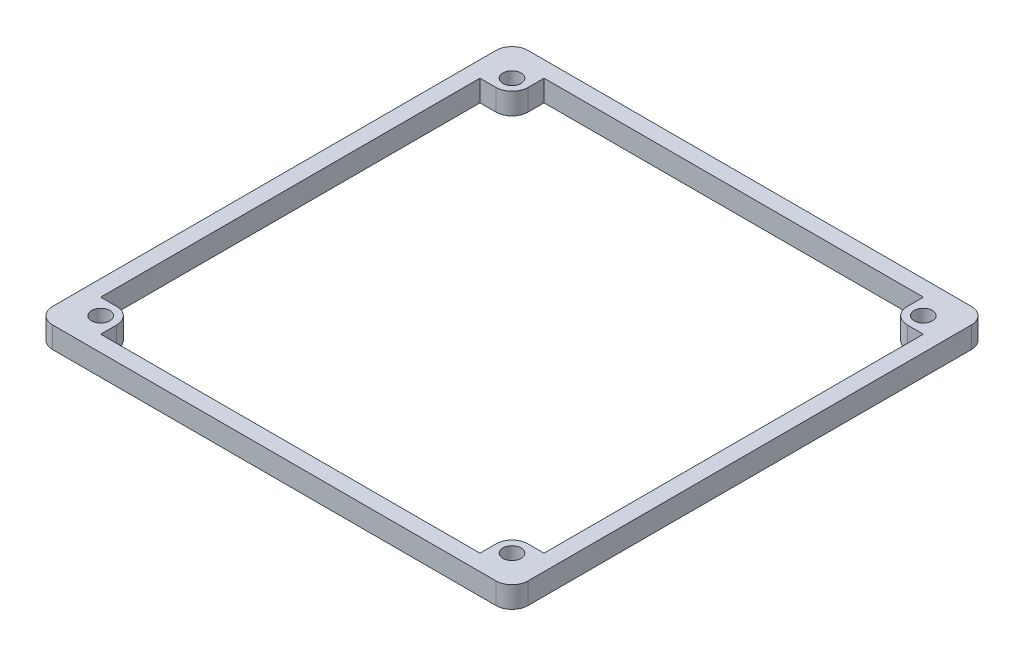
ISO-10303-21;
HEADER;
FILE_DESCRIPTION(('STEP AP214'),'2;1');
FILE_NAME('part.step','',(''),(''),'','','');
FILE_SCHEMA(('AUTOMOTIVE_DESIGN { 1 0 10303 214 1 1 1 1 }'));
ENDSEC;
DATA;
#1=APPLICATION_CONTEXT('core data for automotive mechanical design processes');
#2=APPLICATION_PROTOCOL_DEFINITION('international standard','automotive_design',2000,#1);
#3=PRODUCT_CONTEXT('',#1,'mechanical');
#4=PRODUCT('Part','Part','',(#3));
#5=PRODUCT_RELATED_PRODUCT_CATEGORY('part','',(#4));
#6=PRODUCT_DEFINITION_FORMATION('','',#4);
#7=PRODUCT_DEFINITION_CONTEXT('part definition',#1,'design');
#8=PRODUCT_DEFINITION('design','',#6,#7);
#9=PRODUCT_DEFINITION_SHAPE('','',#8);
#10=(LENGTH_UNIT() NAMED_UNIT(*) SI_UNIT(.MILLI.,.METRE.));
#11=(NAMED_UNIT(*) PLANE_ANGLE_UNIT() SI_UNIT($,.RADIAN.));
#12=(NAMED_UNIT(*) SI_UNIT($,.STERADIAN.) SOLID_ANGLE_UNIT());
#13=UNCERTAINTY_MEASURE_WITH_UNIT(LENGTH_MEASURE(1.E-05),#10,'distance_accuracy_value','');
#14=(GEOMETRIC_REPRESENTATION_CONTEXT(3) GLOBAL_UNCERTAINTY_ASSIGNED_CONTEXT((#13)) GLOBAL_UNIT_ASSIGNED_CONTEXT((#10,
#11,#12)) REPRESENTATION_CONTEXT('',''));
#15=CARTESIAN_POINT('',(0.,0.,0.));
#16=DIRECTION('',(0.,0.,1.));
#17=DIRECTION('',(1.,0.,0.));
#18=AXIS2_PLACEMENT_3D('',#15,#16,#17);
#19=CARTESIAN_POINT('',(0.,2.,0.));
#20=DIRECTION('',(0.,-1.,0.));
#21=DIRECTION('',(0.,0.,-1.));
#22=AXIS2_PLACEMENT_3D('',#19,#20,#21);
#23=PLANE('',#22);
#24=DIRECTION('',(-1.,0.,0.));
#25=VECTOR('',#24,1.);
#26=CARTESIAN_POINT('',(3.,2.,-80.));
#27=LINE('',#26,#25);
#28=CARTESIAN_POINT('',(6.,2.,-80.));
#29=VERTEX_POINT('',#28);
#30=CARTESIAN_POINT('',(3.,2.,-80.));
#31=VERTEX_POINT('',#30);
#32=EDGE_CURVE('E804',#29,#31,#27,.T.);
#33=ORIENTED_EDGE('',*,*,#32,.F.);
#34=CARTESIAN_POINT('',(6.,2.,-83.));
#35=DIRECTION('',(0.,-1.,0.));
#36=DIRECTION('',(0.,0.,-1.));
#37=AXIS2_PLACEMENT_3D('',#34,#35,#36);
#38=CIRCLE('',#37,3.);
#39=CARTESIAN_POINT('',(9.,2.,-83.));
#40=VERTEX_POINT('',#39);
#41=EDGE_CURVE('E310',#29,#40,#38,.F.);
#42=ORIENTED_EDGE('',*,*,#41,.T.);
#43=DIRECTION('',(0.,0.,1.));
#44=VECTOR('',#43,1.);
#45=CARTESIAN_POINT('',(9.,2.,-80.));
#46=LINE('',#45,#44);
#47=CARTESIAN_POINT('',(9.,2.,-86.));
#48=VERTEX_POINT('',#47);
#49=EDGE_CURVE('E228',#48,#40,#46,.T.);
#50=ORIENTED_EDGE('',*,*,#49,.F.);
#51=DIRECTION('',(-1.,0.,0.));
#52=VECTOR('',#51,1.);
#53=CARTESIAN_POINT('',(3.,2.,-86.));
#54=LINE('',#53,#52);
#55=CARTESIAN_POINT('',(80.,2.,-86.));
#56=VERTEX_POINT('',#55);
#57=EDGE_CURVE('E219',#56,#48,#54,.T.);
#58=ORIENTED_EDGE('',*,*,#57,.F.);
#59=DIRECTION('',(0.,0.,-1.));
#60=VECTOR('',#59,1.);
#61=CARTESIAN_POINT('',(80.,2.,-80.));
#62=LINE('',#61,#60);
#63=CARTESIAN_POINT('',(80.,2.,-83.));
#64=VERTEX_POINT('',#63);
#65=EDGE_CURVE('E201',#64,#56,#62,.T.);
#66=ORIENTED_EDGE('',*,*,#65,.F.);
#67=CARTESIAN_POINT('',(83.,2.,-83.));
#68=DIRECTION('',(0.,-1.,0.));
#69=DIRECTION('',(0.,0.,-1.));
#70=AXIS2_PLACEMENT_3D('',#67,#68,#69);
#71=CIRCLE('',#70,3.);
#72=CARTESIAN_POINT('',(83.,2.,-80.));
#73=VERTEX_POINT('',#72);
#74=EDGE_CURVE('E307',#64,#73,#71,.F.);
#75=ORIENTED_EDGE('',*,*,#74,.T.);
#76=DIRECTION('',(-1.,0.,0.));
#77=VECTOR('',#76,1.);
#78=CARTESIAN_POINT('',(80.,2.,-80.));
#79=LINE('',#78,#77);
#80=CARTESIAN_POINT('',(86.,2.,-80.));
#81=VERTEX_POINT('',#80);
#82=EDGE_CURVE('E213',#81,#73,#79,.T.);
#83=ORIENTED_EDGE('',*,*,#82,.F.);
#84=DIRECTION('',(0.,0.,-1.));
#85=VECTOR('',#84,1.);
#86=CARTESIAN_POINT('',(86.,2.,-3.00000000000001));
#87=LINE('',#86,#85);
#88=CARTESIAN_POINT('',(86.,2.,-9.00000000000001));
#89=VERTEX_POINT('',#88);
#90=EDGE_CURVE('E231',#89,#81,#87,.T.);
#91=ORIENTED_EDGE('',*,*,#90,.F.);
#92=DIRECTION('',(1.,0.,0.));
#93=VECTOR('',#92,1.);
#94=CARTESIAN_POINT('',(80.,2.,-9.00000000000001));
#95=LINE('',#94,#93);
#96=CARTESIAN_POINT('',(83.,2.,-9.00000000000001));
#97=VERTEX_POINT('',#96);
#98=EDGE_CURVE('E734',#97,#89,#95,.T.);
#99=ORIENTED_EDGE('',*,*,#98,.F.);
#100=CARTESIAN_POINT('',(83.,2.,-6.00000000000001));
#101=DIRECTION('',(0.,-1.,0.));
#102=DIRECTION('',(0.,0.,-1.));
#103=AXIS2_PLACEMENT_3D('',#100,#101,#102);
#104=CIRCLE('',#103,3.);
#105=CARTESIAN_POINT('',(80.,2.,-6.00000000000001));
#106=VERTEX_POINT('',#105);
#107=EDGE_CURVE('E301',#97,#106,#104,.F.);
#108=ORIENTED_EDGE('',*,*,#107,.T.);
#109=DIRECTION('',(0.,0.,-1.));
#110=VECTOR('',#109,1.);
#111=CARTESIAN_POINT('',(80.,2.,-3.00000000000001));
#112=LINE('',#111,#110);
#113=CARTESIAN_POINT('',(80.,2.,-3.00000000000001));
#114=VERTEX_POINT('',#113);
#115=EDGE_CURVE('E729',#114,#106,#112,.T.);
#116=ORIENTED_EDGE('',*,*,#115,.F.);
#117=DIRECTION('',(1.,0.,0.));
#118=VECTOR('',#117,1.);
#119=CARTESIAN_POINT('',(3.,2.,-3.));
#120=LINE('',#119,#118);
#121=CARTESIAN_POINT('',(9.,2.,-3.));
#122=VERTEX_POINT('',#121);
#123=EDGE_CURVE('E239',#122,#114,#120,.T.);
#124=ORIENTED_EDGE('',*,*,#123,.F.);
#125=DIRECTION('',(0.,0.,1.));
#126=VECTOR('',#125,1.);
#127=CARTESIAN_POINT('',(9.,2.,-3.));
#128=LINE('',#127,#126);
#129=CARTESIAN_POINT('',(9.,2.,-6.));
#130=VERTEX_POINT('',#129);
#131=EDGE_CURVE('E757',#130,#122,#128,.T.);
#132=ORIENTED_EDGE('',*,*,#131,.F.);
#133=CARTESIAN_POINT('',(6.,2.,-6.));
#134=DIRECTION('',(0.,-1.,0.));
#135=DIRECTION('',(0.,0.,-1.));
#136=AXIS2_PLACEMENT_3D('',#133,#134,#135);
#137=CIRCLE('',#136,3.);
#138=CARTESIAN_POINT('',(6.,2.,-9.));
#139=VERTEX_POINT('',#138);
#140=EDGE_CURVE('E304',#130,#139,#137,.F.);
#141=ORIENTED_EDGE('',*,*,#140,.T.);
#142=DIRECTION('',(1.,0.,0.));
#143=VECTOR('',#142,1.);
#144=CARTESIAN_POINT('',(3.,2.,-9.));
#145=LINE('',#144,#143);
#146=CARTESIAN_POINT('',(3.,2.,-9.));
#147=VERTEX_POINT('',#146);
#148=EDGE_CURVE('E753',#147,#139,#145,.T.);
#149=ORIENTED_EDGE('',*,*,#148,.F.);
#150=DIRECTION('',(0.,0.,1.));
#151=VECTOR('',#150,1.);
#152=CARTESIAN_POINT('',(3.,2.,-3.));
#153=LINE('',#152,#151);
#154=EDGE_CURVE('E257',#31,#147,#153,.T.);
#155=ORIENTED_EDGE('',*,*,#154,.F.);
#156=EDGE_LOOP('',(#33,#42,#50,#58,#66,#75,#83,#91,#99,#108,#116,#124,#132,#141,#149,#155));
#157=FACE_BOUND('',#156,.T.);
#158=DIRECTION('',(-1.,0.,0.));
#159=VECTOR('',#158,1.);
#160=CARTESIAN_POINT('',(0.,2.,-89.));
#161=LINE('',#160,#159);
#162=CARTESIAN_POINT('',(86.,2.,-89.));
#163=VERTEX_POINT('',#162);
#164=CARTESIAN_POINT('',(3.00000000000001,2.,-89.));
#165=VERTEX_POINT('',#164);
#166=EDGE_CURVE('E269',#163,#165,#161,.T.);
#167=ORIENTED_EDGE('',*,*,#166,.T.);
#168=CARTESIAN_POINT('',(3.00000000000001,2.,-86.));
#169=DIRECTION('',(0.,-1.,0.));
#170=DIRECTION('',(0.,0.,-1.));
#171=AXIS2_PLACEMENT_3D('',#168,#169,#170);
#172=CIRCLE('',#171,3.);
#173=CARTESIAN_POINT('',(0.,2.,-86.));
#174=VERTEX_POINT('',#173);
#175=EDGE_CURVE('E367',#165,#174,#172,.F.);
#176=ORIENTED_EDGE('',*,*,#175,.T.);
#177=DIRECTION('',(0.,0.,1.));
#178=VECTOR('',#177,1.);
#179=CARTESIAN_POINT('',(0.,2.,0.));
#180=LINE('',#179,#178);
#181=CARTESIAN_POINT('',(0.,2.,-3.));
#182=VERTEX_POINT('',#181);
#183=EDGE_CURVE('E258',#174,#182,#180,.T.);
#184=ORIENTED_EDGE('',*,*,#183,.T.);
#185=CARTESIAN_POINT('',(3.,2.,-3.));
#186=DIRECTION('',(0.,-1.,0.));
#187=DIRECTION('',(0.,0.,-1.));
#188=AXIS2_PLACEMENT_3D('',#185,#186,#187);
#189=CIRCLE('',#188,3.);
#190=CARTESIAN_POINT('',(3.,2.,0.));
#191=VERTEX_POINT('',#190);
#192=EDGE_CURVE('E364',#182,#191,#189,.F.);
#193=ORIENTED_EDGE('',*,*,#192,.T.);
#194=DIRECTION('',(1.,0.,0.));
#195=VECTOR('',#194,1.);
#196=CARTESIAN_POINT('',(0.,2.,0.));
#197=LINE('',#196,#195);
#198=CARTESIAN_POINT('',(86.,2.,0.));
#199=VERTEX_POINT('',#198);
#200=EDGE_CURVE('E262',#191,#199,#197,.T.);
#201=ORIENTED_EDGE('',*,*,#200,.T.);
#202=CARTESIAN_POINT('',(86.,2.,-3.00000000000001));
#203=DIRECTION('',(0.,-1.,0.));
#204=DIRECTION('',(0.,0.,-1.));
#205=AXIS2_PLACEMENT_3D('',#202,#203,#204);
#206=CIRCLE('',#205,3.);
#207=CARTESIAN_POINT('',(89.,2.,-3.00000000000001));
#208=VERTEX_POINT('',#207);
#209=EDGE_CURVE('E60',#199,#208,#206,.F.);
#210=ORIENTED_EDGE('',*,*,#209,.T.);
#211=DIRECTION('',(0.,0.,-1.));
#212=VECTOR('',#211,1.);
#213=CARTESIAN_POINT('',(89.,2.,0.));
#214=LINE('',#213,#212);
#215=CARTESIAN_POINT('',(89.,2.,-86.));
#216=VERTEX_POINT('',#215);
#217=EDGE_CURVE('E266',#208,#216,#214,.T.);
#218=ORIENTED_EDGE('',*,*,#217,.T.);
#219=CARTESIAN_POINT('',(86.,2.,-86.));
#220=DIRECTION('',(0.,-1.,0.));
#221=DIRECTION('',(0.,0.,-1.));
#222=AXIS2_PLACEMENT_3D('',#219,#220,#221);
#223=CIRCLE('',#222,3.);
#224=EDGE_CURVE('E361',#216,#163,#223,.F.);
#225=ORIENTED_EDGE('',*,*,#224,.T.);
#226=EDGE_LOOP('',(#167,#176,#184,#193,#201,#210,#218,#225));
#227=FACE_BOUND('',#226,.T.);
#228=CARTESIAN_POINT('',(6.,2.,-6.));
#229=DIRECTION('',(0.,-1.,0.));
#230=DIRECTION('',(0.,0.,-1.));
#231=AXIS2_PLACEMENT_3D('',#228,#229,#230);
#232=CIRCLE('',#231,1.7);
#233=CARTESIAN_POINT('',(6.,2.,-7.7));
#234=VERTEX_POINT('',#233);
#235=EDGE_CURVE('E745',#234,#234,#232,.T.);
#236=ORIENTED_EDGE('',*,*,#235,.T.);
#237=EDGE_LOOP('',(#236));
#238=FACE_BOUND('',#237,.T.);
#239=CARTESIAN_POINT('',(83.,2.,-6.00000000000001));
#240=DIRECTION('',(0.,-1.,0.));
#241=DIRECTION('',(0.,0.,-1.));
#242=AXIS2_PLACEMENT_3D('',#239,#240,#241);
#243=CIRCLE('',#242,1.7);
#244=CARTESIAN_POINT('',(83.,2.,-7.70000000000001));
#245=VERTEX_POINT('',#244);
#246=EDGE_CURVE('E792',#245,#245,#243,.T.);
#247=ORIENTED_EDGE('',*,*,#246,.T.);
#248=EDGE_LOOP('',(#247));
#249=FACE_BOUND('',#248,.T.);
#250=CARTESIAN_POINT('',(6.,2.,-83.));
#251=DIRECTION('',(0.,-1.,0.));
#252=DIRECTION('',(0.,0.,-1.));
#253=AXIS2_PLACEMENT_3D('',#250,#251,#252);
#254=CIRCLE('',#253,1.70000000000001);
#255=CARTESIAN_POINT('',(6.,2.,-84.7));
#256=VERTEX_POINT('',#255);
#257=EDGE_CURVE('E814',#256,#256,#254,.T.);
#258=ORIENTED_EDGE('',*,*,#257,.T.);
#259=EDGE_LOOP('',(#258));
#260=FACE_BOUND('',#259,.T.);
#261=CARTESIAN_POINT('',(83.,2.,-83.));
#262=DIRECTION('',(0.,-1.,0.));
#263=DIRECTION('',(0.,0.,-1.));
#264=AXIS2_PLACEMENT_3D('',#261,#262,#263);
#265=CIRCLE('',#264,1.70000000000001);
#266=CARTESIAN_POINT('',(83.,2.,-84.7));
#267=VERTEX_POINT('',#266);
#268=EDGE_CURVE('E830',#267,#267,#265,.T.);
#269=ORIENTED_EDGE('',*,*,#268,.T.);
#270=EDGE_LOOP('',(#269));
#271=FACE_BOUND('',#270,.T.);
#272=ADVANCED_FACE('F39',(#157,#227,#238,#249,#260,#271),#23,.F.);
#273=CARTESIAN_POINT('',(0.,-2.,0.));
#274=DIRECTION('',(0.,-1.,0.));
#275=DIRECTION('',(0.,0.,-1.));
#276=AXIS2_PLACEMENT_3D('',#273,#274,#275);
#277=PLANE('',#276);
#278=DIRECTION('',(0.,0.,1.));
#279=VECTOR('',#278,1.);
#280=CARTESIAN_POINT('',(9.,-2.,-80.));
#281=LINE('',#280,#279);
#282=CARTESIAN_POINT('',(9.,-2.,-86.));
#283=VERTEX_POINT('',#282);
#284=CARTESIAN_POINT('',(9.,-2.,-83.));
#285=VERTEX_POINT('',#284);
#286=EDGE_CURVE('E811',#283,#285,#281,.T.);
#287=ORIENTED_EDGE('',*,*,#286,.T.);
#288=CARTESIAN_POINT('',(6.,-2.,-83.));
#289=DIRECTION('',(0.,-1.,0.));
#290=DIRECTION('',(0.,0.,-1.));
#291=AXIS2_PLACEMENT_3D('',#288,#289,#290);
#292=CIRCLE('',#291,3.);
#293=CARTESIAN_POINT('',(6.,-2.,-80.));
#294=VERTEX_POINT('',#293);
#295=EDGE_CURVE('E295',#285,#294,#292,.T.);
#296=ORIENTED_EDGE('',*,*,#295,.T.);
#297=DIRECTION('',(-1.,0.,0.));
#298=VECTOR('',#297,1.);
#299=CARTESIAN_POINT('',(3.,-2.,-80.));
#300=LINE('',#299,#298);
#301=CARTESIAN_POINT('',(3.,-2.,-80.));
#302=VERTEX_POINT('',#301);
#303=EDGE_CURVE('E808',#294,#302,#300,.T.);
#304=ORIENTED_EDGE('',*,*,#303,.T.);
#305=DIRECTION('',(0.,0.,1.));
#306=VECTOR('',#305,1.);
#307=CARTESIAN_POINT('',(3.,-2.,-3.));
#308=LINE('',#307,#306);
#309=CARTESIAN_POINT('',(3.,-2.,-9.));
#310=VERTEX_POINT('',#309);
#311=EDGE_CURVE('E243',#302,#310,#308,.T.);
#312=ORIENTED_EDGE('',*,*,#311,.T.);
#313=DIRECTION('',(1.,0.,0.));
#314=VECTOR('',#313,1.);
#315=CARTESIAN_POINT('',(3.,-2.,-9.));
#316=LINE('',#315,#314);
#317=CARTESIAN_POINT('',(6.,-2.,-9.));
#318=VERTEX_POINT('',#317);
#319=EDGE_CURVE('E749',#310,#318,#316,.T.);
#320=ORIENTED_EDGE('',*,*,#319,.T.);
#321=CARTESIAN_POINT('',(6.,-2.,-6.));
#322=DIRECTION('',(0.,-1.,0.));
#323=DIRECTION('',(0.,0.,-1.));
#324=AXIS2_PLACEMENT_3D('',#321,#322,#323);
#325=CIRCLE('',#324,3.);
#326=CARTESIAN_POINT('',(9.,-2.,-6.));
#327=VERTEX_POINT('',#326);
#328=EDGE_CURVE('E289',#318,#327,#325,.T.);
#329=ORIENTED_EDGE('',*,*,#328,.T.);
#330=DIRECTION('',(0.,0.,1.));
#331=VECTOR('',#330,1.);
#332=CARTESIAN_POINT('',(9.,-2.,-3.));
#333=LINE('',#332,#331);
#334=CARTESIAN_POINT('',(9.,-2.,-3.));
#335=VERTEX_POINT('',#334);
#336=EDGE_CURVE('E758',#327,#335,#333,.T.);
#337=ORIENTED_EDGE('',*,*,#336,.T.);
#338=DIRECTION('',(1.,0.,0.));
#339=VECTOR('',#338,1.);
#340=CARTESIAN_POINT('',(3.,-2.,-3.));
#341=LINE('',#340,#339);
#342=CARTESIAN_POINT('',(80.,-2.,-3.00000000000001));
#343=VERTEX_POINT('',#342);
#344=EDGE_CURVE('E246',#335,#343,#341,.T.);
#345=ORIENTED_EDGE('',*,*,#344,.T.);
#346=DIRECTION('',(0.,0.,-1.));
#347=VECTOR('',#346,1.);
#348=CARTESIAN_POINT('',(80.,-2.,-3.00000000000001));
#349=LINE('',#348,#347);
#350=CARTESIAN_POINT('',(80.,-2.,-6.00000000000001));
#351=VERTEX_POINT('',#350);
#352=EDGE_CURVE('E730',#343,#351,#349,.T.);
#353=ORIENTED_EDGE('',*,*,#352,.T.);
#354=CARTESIAN_POINT('',(83.,-2.,-6.00000000000001));
#355=DIRECTION('',(0.,-1.,0.));
#356=DIRECTION('',(0.,0.,-1.));
#357=AXIS2_PLACEMENT_3D('',#354,#355,#356);
#358=CIRCLE('',#357,3.);
#359=CARTESIAN_POINT('',(83.,-2.,-9.00000000000001));
#360=VERTEX_POINT('',#359);
#361=EDGE_CURVE('E286',#351,#360,#358,.T.);
#362=ORIENTED_EDGE('',*,*,#361,.T.);
#363=DIRECTION('',(1.,0.,0.));
#364=VECTOR('',#363,1.);
#365=CARTESIAN_POINT('',(80.,-2.,-9.00000000000001));
#366=LINE('',#365,#364);
#367=CARTESIAN_POINT('',(86.,-2.,-9.00000000000001));
#368=VERTEX_POINT('',#367);
#369=EDGE_CURVE('E724',#360,#368,#366,.T.);
#370=ORIENTED_EDGE('',*,*,#369,.T.);
#371=DIRECTION('',(0.,0.,-1.));
#372=VECTOR('',#371,1.);
#373=CARTESIAN_POINT('',(86.,-2.,-3.00000000000001));
#374=LINE('',#373,#372);
#375=CARTESIAN_POINT('',(86.,-2.,-80.));
#376=VERTEX_POINT('',#375);
#377=EDGE_CURVE('E251',#368,#376,#374,.T.);
#378=ORIENTED_EDGE('',*,*,#377,.T.);
#379=DIRECTION('',(-1.,0.,0.));
#380=VECTOR('',#379,1.);
#381=CARTESIAN_POINT('',(80.,-2.,-80.));
#382=LINE('',#381,#380);
#383=CARTESIAN_POINT('',(83.,-2.,-80.));
#384=VERTEX_POINT('',#383);
#385=EDGE_CURVE('E214',#376,#384,#382,.T.);
#386=ORIENTED_EDGE('',*,*,#385,.T.);
#387=CARTESIAN_POINT('',(83.,-2.,-83.));
#388=DIRECTION('',(0.,-1.,0.));
#389=DIRECTION('',(0.,0.,-1.));
#390=AXIS2_PLACEMENT_3D('',#387,#388,#389);
#391=CIRCLE('',#390,3.);
#392=CARTESIAN_POINT('',(80.,-2.,-83.));
#393=VERTEX_POINT('',#392);
#394=EDGE_CURVE('E292',#384,#393,#391,.T.);
#395=ORIENTED_EDGE('',*,*,#394,.T.);
#396=DIRECTION('',(0.,0.,-1.));
#397=VECTOR('',#396,1.);
#398=CARTESIAN_POINT('',(80.,-2.,-80.));
#399=LINE('',#398,#397);
#400=CARTESIAN_POINT('',(80.,-2.,-86.));
#401=VERTEX_POINT('',#400);
#402=EDGE_CURVE('E827',#393,#401,#399,.T.);
#403=ORIENTED_EDGE('',*,*,#402,.T.);
#404=DIRECTION('',(-1.,0.,0.));
#405=VECTOR('',#404,1.);
#406=CARTESIAN_POINT('',(3.,-2.,-86.));
#407=LINE('',#406,#405);
#408=EDGE_CURVE('E221',#401,#283,#407,.T.);
#409=ORIENTED_EDGE('',*,*,#408,.T.);
#410=EDGE_LOOP('',(#287,#296,#304,#312,#320,#329,#337,#345,#353,#362,#370,#378,#386,#395,#403,#409));
#411=FACE_BOUND('',#410,.T.);
#412=DIRECTION('',(0.,0.,1.));
#413=VECTOR('',#412,1.);
#414=CARTESIAN_POINT('',(0.,-2.,0.));
#415=LINE('',#414,#413);
#416=CARTESIAN_POINT('',(0.,-2.,-86.));
#417=VERTEX_POINT('',#416);
#418=CARTESIAN_POINT('',(0.,-2.,-3.));
#419=VERTEX_POINT('',#418);
#420=EDGE_CURVE('E230',#417,#419,#415,.T.);
#421=ORIENTED_EDGE('',*,*,#420,.F.);
#422=CARTESIAN_POINT('',(3.00000000000001,-2.,-86.));
#423=DIRECTION('',(0.,-1.,0.));
#424=DIRECTION('',(0.,0.,-1.));
#425=AXIS2_PLACEMENT_3D('',#422,#423,#424);
#426=CIRCLE('',#425,3.);
#427=CARTESIAN_POINT('',(3.00000000000001,-2.,-89.));
#428=VERTEX_POINT('',#427);
#429=EDGE_CURVE('E349',#417,#428,#426,.T.);
#430=ORIENTED_EDGE('',*,*,#429,.T.);
#431=DIRECTION('',(-1.,0.,0.));
#432=VECTOR('',#431,1.);
#433=CARTESIAN_POINT('',(0.,-2.,-89.));
#434=LINE('',#433,#432);
#435=CARTESIAN_POINT('',(86.,-2.,-89.));
#436=VERTEX_POINT('',#435);
#437=EDGE_CURVE('E263',#436,#428,#434,.T.);
#438=ORIENTED_EDGE('',*,*,#437,.F.);
#439=CARTESIAN_POINT('',(86.,-2.,-86.));
#440=DIRECTION('',(0.,-1.,0.));
#441=DIRECTION('',(0.,0.,-1.));
#442=AXIS2_PLACEMENT_3D('',#439,#440,#441);
#443=CIRCLE('',#442,3.);
#444=CARTESIAN_POINT('',(89.,-2.,-86.));
#445=VERTEX_POINT('',#444);
#446=EDGE_CURVE('E343',#436,#445,#443,.T.);
#447=ORIENTED_EDGE('',*,*,#446,.T.);
#448=DIRECTION('',(0.,0.,-1.));
#449=VECTOR('',#448,1.);
#450=CARTESIAN_POINT('',(89.,-2.,0.));
#451=LINE('',#450,#449);
#452=CARTESIAN_POINT('',(89.,-2.,-3.00000000000001));
#453=VERTEX_POINT('',#452);
#454=EDGE_CURVE('E277',#453,#445,#451,.T.);
#455=ORIENTED_EDGE('',*,*,#454,.F.);
#456=CARTESIAN_POINT('',(86.,-2.,-3.00000000000001));
#457=DIRECTION('',(0.,-1.,0.));
#458=DIRECTION('',(0.,0.,-1.));
#459=AXIS2_PLACEMENT_3D('',#456,#457,#458);
#460=CIRCLE('',#459,3.);
#461=CARTESIAN_POINT('',(86.,-2.,0.));
#462=VERTEX_POINT('',#461);
#463=EDGE_CURVE('E340',#453,#462,#460,.T.);
#464=ORIENTED_EDGE('',*,*,#463,.T.);
#465=DIRECTION('',(1.,0.,0.));
#466=VECTOR('',#465,1.);
#467=CARTESIAN_POINT('',(0.,-2.,0.));
#468=LINE('',#467,#466);
#469=CARTESIAN_POINT('',(3.,-2.,0.));
#470=VERTEX_POINT('',#469);
#471=EDGE_CURVE('E236',#470,#462,#468,.T.);
#472=ORIENTED_EDGE('',*,*,#471,.F.);
#473=CARTESIAN_POINT('',(3.,-2.,-3.));
#474=DIRECTION('',(0.,-1.,0.));
#475=DIRECTION('',(0.,0.,-1.));
#476=AXIS2_PLACEMENT_3D('',#473,#474,#475);
#477=CIRCLE('',#476,3.);
#478=EDGE_CURVE('E346',#470,#419,#477,.T.);
#479=ORIENTED_EDGE('',*,*,#478,.T.);
#480=EDGE_LOOP('',(#421,#430,#438,#447,#455,#464,#472,#479));
#481=FACE_BOUND('',#480,.T.);
#482=CARTESIAN_POINT('',(6.,-2.,-6.));
#483=DIRECTION('',(0.,-1.,0.));
#484=DIRECTION('',(0.,0.,-1.));
#485=AXIS2_PLACEMENT_3D('',#482,#483,#484);
#486=CIRCLE('',#485,1.7);
#487=CARTESIAN_POINT('',(6.,-2.,-7.7));
#488=VERTEX_POINT('',#487);
#489=EDGE_CURVE('E741',#488,#488,#486,.T.);
#490=ORIENTED_EDGE('',*,*,#489,.F.);
#491=EDGE_LOOP('',(#490));
#492=FACE_BOUND('',#491,.T.);
#493=CARTESIAN_POINT('',(83.,-2.,-6.00000000000001));
#494=DIRECTION('',(0.,-1.,0.));
#495=DIRECTION('',(0.,0.,-1.));
#496=AXIS2_PLACEMENT_3D('',#493,#494,#495);
#497=CIRCLE('',#496,1.7);
#498=CARTESIAN_POINT('',(83.,-2.,-7.70000000000001));
#499=VERTEX_POINT('',#498);
#500=EDGE_CURVE('E788',#499,#499,#497,.T.);
#501=ORIENTED_EDGE('',*,*,#500,.F.);
#502=EDGE_LOOP('',(#501));
#503=FACE_BOUND('',#502,.T.);
#504=CARTESIAN_POINT('',(6.,-2.,-83.));
#505=DIRECTION('',(0.,-1.,0.));
#506=DIRECTION('',(0.,0.,-1.));
#507=AXIS2_PLACEMENT_3D('',#504,#505,#506);
#508=CIRCLE('',#507,1.70000000000001);
#509=CARTESIAN_POINT('',(6.,-2.,-84.7));
#510=VERTEX_POINT('',#509);
#511=EDGE_CURVE('E719',#510,#510,#508,.T.);
#512=ORIENTED_EDGE('',*,*,#511,.F.);
#513=EDGE_LOOP('',(#512));
#514=FACE_BOUND('',#513,.T.);
#515=CARTESIAN_POINT('',(83.,-2.,-83.));
#516=DIRECTION('',(0.,-1.,0.));
#517=DIRECTION('',(0.,0.,-1.));
#518=AXIS2_PLACEMENT_3D('',#515,#516,#517);
#519=CIRCLE('',#518,1.70000000000001);
#520=CARTESIAN_POINT('',(83.,-2.,-84.7));
#521=VERTEX_POINT('',#520);
#522=EDGE_CURVE('E833',#521,#521,#519,.T.);
#523=ORIENTED_EDGE('',*,*,#522,.F.);
#524=EDGE_LOOP('',(#523));
#525=FACE_BOUND('',#524,.T.);
#526=ADVANCED_FACE('F384',(#411,#481,#492,#503,#514,#525),#277,.T.);
#527=CARTESIAN_POINT('',(0.,2.,0.));
#528=DIRECTION('',(1.,0.,0.));
#529=DIRECTION('',(0.,0.,-1.));
#530=AXIS2_PLACEMENT_3D('',#527,#528,#529);
#531=PLANE('',#530);
#532=ORIENTED_EDGE('',*,*,#183,.F.);
#533=DIRECTION('',(0.,-1.,0.));
#534=VECTOR('',#533,1.);
#535=CARTESIAN_POINT('',(0.,2.,-86.));
#536=LINE('',#535,#534);
#537=EDGE_CURVE('E336',#174,#417,#536,.T.);
#538=ORIENTED_EDGE('',*,*,#537,.T.);
#539=ORIENTED_EDGE('',*,*,#420,.T.);
#540=DIRECTION('',(0.,-1.,0.));
#541=VECTOR('',#540,1.);
#542=CARTESIAN_POINT('',(0.,2.,-3.));
#543=LINE('',#542,#541);
#544=EDGE_CURVE('E333',#419,#182,#543,.F.);
#545=ORIENTED_EDGE('',*,*,#544,.T.);
#546=EDGE_LOOP('',(#532,#538,#539,#545));
#547=FACE_BOUND('',#546,.T.);
#548=ADVANCED_FACE('F403',(#547),#531,.F.);
#549=CARTESIAN_POINT('',(0.,2.,0.));
#550=DIRECTION('',(0.,0.,-1.));
#551=DIRECTION('',(-1.,0.,0.));
#552=AXIS2_PLACEMENT_3D('',#549,#550,#551);
#553=PLANE('',#552);
#554=ORIENTED_EDGE('',*,*,#200,.F.);
#555=DIRECTION('',(0.,-1.,0.));
#556=VECTOR('',#555,1.);
#557=CARTESIAN_POINT('',(3.,2.,0.));
#558=LINE('',#557,#556);
#559=EDGE_CURVE('E373',#191,#470,#558,.T.);
#560=ORIENTED_EDGE('',*,*,#559,.T.);
#561=ORIENTED_EDGE('',*,*,#471,.T.);
#562=DIRECTION('',(0.,-1.,0.));
#563=VECTOR('',#562,1.);
#564=CARTESIAN_POINT('',(86.,2.,0.));
#565=LINE('',#564,#563);
#566=EDGE_CURVE('E370',#462,#199,#565,.F.);
#567=ORIENTED_EDGE('',*,*,#566,.T.);
#568=EDGE_LOOP('',(#554,#560,#561,#567));
#569=FACE_BOUND('',#568,.T.);
#570=ADVANCED_FACE('F411',(#569),#553,.F.);
#571=CARTESIAN_POINT('',(89.,2.,0.));
#572=DIRECTION('',(-1.,0.,0.));
#573=DIRECTION('',(0.,0.,1.));
#574=AXIS2_PLACEMENT_3D('',#571,#572,#573);
#575=PLANE('',#574);
#576=ORIENTED_EDGE('',*,*,#454,.T.);
#577=DIRECTION('',(0.,-1.,0.));
#578=VECTOR('',#577,1.);
#579=CARTESIAN_POINT('',(89.,2.,-86.));
#580=LINE('',#579,#578);
#581=EDGE_CURVE('E11',#445,#216,#580,.F.);
#582=ORIENTED_EDGE('',*,*,#581,.T.);
#583=ORIENTED_EDGE('',*,*,#217,.F.);
#584=DIRECTION('',(0.,-1.,0.));
#585=VECTOR('',#584,1.);
#586=CARTESIAN_POINT('',(89.,2.,-3.00000000000001));
#587=LINE('',#586,#585);
#588=EDGE_CURVE('E48',#208,#453,#587,.T.);
#589=ORIENTED_EDGE('',*,*,#588,.T.);
#590=EDGE_LOOP('',(#576,#582,#583,#589));
#591=FACE_BOUND('',#590,.T.);
#592=ADVANCED_FACE('F380',(#591),#575,.F.);
#593=CARTESIAN_POINT('',(0.,2.,-89.));
#594=DIRECTION('',(0.,0.,1.));
#595=DIRECTION('',(1.,0.,0.));
#596=AXIS2_PLACEMENT_3D('',#593,#594,#595);
#597=PLANE('',#596);
#598=ORIENTED_EDGE('',*,*,#437,.T.);
#599=DIRECTION('',(0.,-1.,0.));
#600=VECTOR('',#599,1.);
#601=CARTESIAN_POINT('',(3.00000000000001,2.,-89.));
#602=LINE('',#601,#600);
#603=EDGE_CURVE('E356',#428,#165,#602,.F.);
#604=ORIENTED_EDGE('',*,*,#603,.T.);
#605=ORIENTED_EDGE('',*,*,#166,.F.);
#606=DIRECTION('',(0.,-1.,0.));
#607=VECTOR('',#606,1.);
#608=CARTESIAN_POINT('',(86.,2.,-89.));
#609=LINE('',#608,#607);
#610=EDGE_CURVE('E352',#163,#436,#609,.T.);
#611=ORIENTED_EDGE('',*,*,#610,.T.);
#612=EDGE_LOOP('',(#598,#604,#605,#611));
#613=FACE_BOUND('',#612,.T.);
#614=ADVANCED_FACE('F394',(#613),#597,.F.);
#615=CARTESIAN_POINT('',(3.,2.,-3.));
#616=DIRECTION('',(1.,0.,0.));
#617=DIRECTION('',(0.,0.,-1.));
#618=AXIS2_PLACEMENT_3D('',#615,#616,#617);
#619=PLANE('',#618);
#620=DIRECTION('',(0.,-1.,0.));
#621=VECTOR('',#620,1.);
#622=CARTESIAN_POINT('',(3.,2.,-80.));
#623=LINE('',#622,#621);
#624=EDGE_CURVE('E799',#31,#302,#623,.T.);
#625=ORIENTED_EDGE('',*,*,#624,.F.);
#626=ORIENTED_EDGE('',*,*,#154,.T.);
#627=DIRECTION('',(0.,-1.,0.));
#628=VECTOR('',#627,1.);
#629=CARTESIAN_POINT('',(3.,2.,-9.));
#630=LINE('',#629,#628);
#631=EDGE_CURVE('E761',#147,#310,#630,.T.);
#632=ORIENTED_EDGE('',*,*,#631,.T.);
#633=ORIENTED_EDGE('',*,*,#311,.F.);
#634=EDGE_LOOP('',(#625,#626,#632,#633));
#635=FACE_BOUND('',#634,.T.);
#636=ADVANCED_FACE('F425',(#635),#619,.T.);
#637=CARTESIAN_POINT('',(3.,2.,-3.));
#638=DIRECTION('',(0.,0.,-1.));
#639=DIRECTION('',(-1.,0.,0.));
#640=AXIS2_PLACEMENT_3D('',#637,#638,#639);
#641=PLANE('',#640);
#642=DIRECTION('',(0.,-1.,0.));
#643=VECTOR('',#642,1.);
#644=CARTESIAN_POINT('',(80.,2.,-3.00000000000001));
#645=LINE('',#644,#643);
#646=EDGE_CURVE('E736',#114,#343,#645,.T.);
#647=ORIENTED_EDGE('',*,*,#646,.T.);
#648=ORIENTED_EDGE('',*,*,#344,.F.);
#649=DIRECTION('',(0.,-1.,0.));
#650=VECTOR('',#649,1.);
#651=CARTESIAN_POINT('',(9.,2.,-3.));
#652=LINE('',#651,#650);
#653=EDGE_CURVE('E247',#122,#335,#652,.T.);
#654=ORIENTED_EDGE('',*,*,#653,.F.);
#655=ORIENTED_EDGE('',*,*,#123,.T.);
#656=EDGE_LOOP('',(#647,#648,#654,#655));
#657=FACE_BOUND('',#656,.T.);
#658=ADVANCED_FACE('F646',(#657),#641,.T.);
#659=CARTESIAN_POINT('',(86.,2.,-3.00000000000001));
#660=DIRECTION('',(-1.,0.,0.));
#661=DIRECTION('',(0.,0.,1.));
#662=AXIS2_PLACEMENT_3D('',#659,#660,#661);
#663=PLANE('',#662);
#664=DIRECTION('',(0.,-1.,0.));
#665=VECTOR('',#664,1.);
#666=CARTESIAN_POINT('',(86.,2.,-80.));
#667=LINE('',#666,#665);
#668=EDGE_CURVE('E223',#81,#376,#667,.T.);
#669=ORIENTED_EDGE('',*,*,#668,.T.);
#670=ORIENTED_EDGE('',*,*,#377,.F.);
#671=DIRECTION('',(0.,-1.,0.));
#672=VECTOR('',#671,1.);
#673=CARTESIAN_POINT('',(86.,2.,-9.00000000000001));
#674=LINE('',#673,#672);
#675=EDGE_CURVE('E732',#89,#368,#674,.T.);
#676=ORIENTED_EDGE('',*,*,#675,.F.);
#677=ORIENTED_EDGE('',*,*,#90,.T.);
#678=EDGE_LOOP('',(#669,#670,#676,#677));
#679=FACE_BOUND('',#678,.T.);
#680=ADVANCED_FACE('F652',(#679),#663,.T.);
#681=CARTESIAN_POINT('',(3.,2.,-86.));
#682=DIRECTION('',(0.,0.,1.));
#683=DIRECTION('',(1.,0.,0.));
#684=AXIS2_PLACEMENT_3D('',#681,#682,#683);
#685=PLANE('',#684);
#686=DIRECTION('',(0.,-1.,0.));
#687=VECTOR('',#686,1.);
#688=CARTESIAN_POINT('',(80.,2.,-86.));
#689=LINE('',#688,#687);
#690=EDGE_CURVE('E205',#56,#401,#689,.T.);
#691=ORIENTED_EDGE('',*,*,#690,.F.);
#692=ORIENTED_EDGE('',*,*,#57,.T.);
#693=DIRECTION('',(0.,-1.,0.));
#694=VECTOR('',#693,1.);
#695=CARTESIAN_POINT('',(9.,2.,-86.));
#696=LINE('',#695,#694);
#697=EDGE_CURVE('E801',#48,#283,#696,.T.);
#698=ORIENTED_EDGE('',*,*,#697,.T.);
#699=ORIENTED_EDGE('',*,*,#408,.F.);
#700=EDGE_LOOP('',(#691,#692,#698,#699));
#701=FACE_BOUND('',#700,.T.);
#702=ADVANCED_FACE('F217',(#701),#685,.T.);
#703=CARTESIAN_POINT('',(9.,2.,-3.));
#704=DIRECTION('',(1.,0.,0.));
#705=DIRECTION('',(0.,0.,-1.));
#706=AXIS2_PLACEMENT_3D('',#703,#704,#705);
#707=PLANE('',#706);
#708=ORIENTED_EDGE('',*,*,#336,.F.);
#709=DIRECTION('',(0.,-1.,0.));
#710=VECTOR('',#709,1.);
#711=CARTESIAN_POINT('',(9.,2.,-6.));
#712=LINE('',#711,#710);
#713=EDGE_CURVE('E323',#327,#130,#712,.F.);
#714=ORIENTED_EDGE('',*,*,#713,.T.);
#715=ORIENTED_EDGE('',*,*,#131,.T.);
#716=ORIENTED_EDGE('',*,*,#653,.T.);
#717=EDGE_LOOP('',(#708,#714,#715,#716));
#718=FACE_BOUND('',#717,.T.);
#719=ADVANCED_FACE('F595',(#718),#707,.T.);
#720=CARTESIAN_POINT('',(3.,2.,-9.));
#721=DIRECTION('',(0.,0.,-1.));
#722=DIRECTION('',(-1.,0.,0.));
#723=AXIS2_PLACEMENT_3D('',#720,#721,#722);
#724=PLANE('',#723);
#725=ORIENTED_EDGE('',*,*,#148,.T.);
#726=DIRECTION('',(0.,-1.,0.));
#727=VECTOR('',#726,1.);
#728=CARTESIAN_POINT('',(6.,2.,-9.));
#729=LINE('',#728,#727);
#730=EDGE_CURVE('E319',#139,#318,#729,.T.);
#731=ORIENTED_EDGE('',*,*,#730,.T.);
#732=ORIENTED_EDGE('',*,*,#319,.F.);
#733=ORIENTED_EDGE('',*,*,#631,.F.);
#734=EDGE_LOOP('',(#725,#731,#732,#733));
#735=FACE_BOUND('',#734,.T.);
#736=ADVANCED_FACE('F586',(#735),#724,.T.);
#737=CARTESIAN_POINT('',(6.,2.,-6.));
#738=DIRECTION('',(0.,-1.,0.));
#739=DIRECTION('',(0.,0.,-1.));
#740=AXIS2_PLACEMENT_3D('',#737,#738,#739);
#741=CYLINDRICAL_SURFACE('',#740,1.7);
#742=ORIENTED_EDGE('',*,*,#235,.F.);
#743=EDGE_LOOP('',(#742));
#744=FACE_BOUND('',#743,.T.);
#745=ORIENTED_EDGE('',*,*,#489,.T.);
#746=EDGE_LOOP('',(#745));
#747=FACE_BOUND('',#746,.T.);
#748=ADVANCED_FACE('F577',(#744,#747),#741,.F.);
#749=CARTESIAN_POINT('',(80.,2.,-3.00000000000001));
#750=DIRECTION('',(-1.,0.,0.));
#751=DIRECTION('',(0.,0.,1.));
#752=AXIS2_PLACEMENT_3D('',#749,#750,#751);
#753=PLANE('',#752);
#754=ORIENTED_EDGE('',*,*,#115,.T.);
#755=DIRECTION('',(0.,-1.,0.));
#756=VECTOR('',#755,1.);
#757=CARTESIAN_POINT('',(80.,2.,-6.00000000000001));
#758=LINE('',#757,#756);
#759=EDGE_CURVE('E326',#106,#351,#758,.T.);
#760=ORIENTED_EDGE('',*,*,#759,.T.);
#761=ORIENTED_EDGE('',*,*,#352,.F.);
#762=ORIENTED_EDGE('',*,*,#646,.F.);
#763=EDGE_LOOP('',(#754,#760,#761,#762));
#764=FACE_BOUND('',#763,.T.);
#765=ADVANCED_FACE('F568',(#764),#753,.T.);
#766=CARTESIAN_POINT('',(80.,2.,-9.00000000000001));
#767=DIRECTION('',(0.,0.,-1.));
#768=DIRECTION('',(-1.,0.,0.));
#769=AXIS2_PLACEMENT_3D('',#766,#767,#768);
#770=PLANE('',#769);
#771=ORIENTED_EDGE('',*,*,#369,.F.);
#772=DIRECTION('',(0.,-1.,0.));
#773=VECTOR('',#772,1.);
#774=CARTESIAN_POINT('',(83.,2.,-9.00000000000001));
#775=LINE('',#774,#773);
#776=EDGE_CURVE('E330',#360,#97,#775,.F.);
#777=ORIENTED_EDGE('',*,*,#776,.T.);
#778=ORIENTED_EDGE('',*,*,#98,.T.);
#779=ORIENTED_EDGE('',*,*,#675,.T.);
#780=EDGE_LOOP('',(#771,#777,#778,#779));
#781=FACE_BOUND('',#780,.T.);
#782=ADVANCED_FACE('F559',(#781),#770,.T.);
#783=CARTESIAN_POINT('',(83.,2.,-6.00000000000001));
#784=DIRECTION('',(0.,-1.,0.));
#785=DIRECTION('',(0.,0.,-1.));
#786=AXIS2_PLACEMENT_3D('',#783,#784,#785);
#787=CYLINDRICAL_SURFACE('',#786,1.7);
#788=ORIENTED_EDGE('',*,*,#246,.F.);
#789=EDGE_LOOP('',(#788));
#790=FACE_BOUND('',#789,.T.);
#791=ORIENTED_EDGE('',*,*,#500,.T.);
#792=EDGE_LOOP('',(#791));
#793=FACE_BOUND('',#792,.T.);
#794=ADVANCED_FACE('F550',(#790,#793),#787,.F.);
#795=CARTESIAN_POINT('',(3.,2.,-80.));
#796=DIRECTION('',(0.,0.,1.));
#797=DIRECTION('',(1.,0.,0.));
#798=AXIS2_PLACEMENT_3D('',#795,#796,#797);
#799=PLANE('',#798);
#800=ORIENTED_EDGE('',*,*,#303,.F.);
#801=DIRECTION('',(0.,-1.,0.));
#802=VECTOR('',#801,1.);
#803=CARTESIAN_POINT('',(6.,2.,-80.));
#804=LINE('',#803,#802);
#805=EDGE_CURVE('E298',#294,#29,#804,.F.);
#806=ORIENTED_EDGE('',*,*,#805,.T.);
#807=ORIENTED_EDGE('',*,*,#32,.T.);
#808=ORIENTED_EDGE('',*,*,#624,.T.);
#809=EDGE_LOOP('',(#800,#806,#807,#808));
#810=FACE_BOUND('',#809,.T.);
#811=ADVANCED_FACE('F541',(#810),#799,.T.);
#812=CARTESIAN_POINT('',(9.,2.,-80.));
#813=DIRECTION('',(1.,0.,0.));
#814=DIRECTION('',(0.,0.,-1.));
#815=AXIS2_PLACEMENT_3D('',#812,#813,#814);
#816=PLANE('',#815);
#817=ORIENTED_EDGE('',*,*,#49,.T.);
#818=DIRECTION('',(0.,-1.,0.));
#819=VECTOR('',#818,1.);
#820=CARTESIAN_POINT('',(9.,2.,-83.));
#821=LINE('',#820,#819);
#822=EDGE_CURVE('E272',#40,#285,#821,.T.);
#823=ORIENTED_EDGE('',*,*,#822,.T.);
#824=ORIENTED_EDGE('',*,*,#286,.F.);
#825=ORIENTED_EDGE('',*,*,#697,.F.);
#826=EDGE_LOOP('',(#817,#823,#824,#825));
#827=FACE_BOUND('',#826,.T.);
#828=ADVANCED_FACE('F532',(#827),#816,.T.);
#829=CARTESIAN_POINT('',(6.,2.,-83.));
#830=DIRECTION('',(0.,-1.,0.));
#831=DIRECTION('',(0.,0.,-1.));
#832=AXIS2_PLACEMENT_3D('',#829,#830,#831);
#833=CYLINDRICAL_SURFACE('',#832,1.70000000000001);
#834=ORIENTED_EDGE('',*,*,#257,.F.);
#835=EDGE_LOOP('',(#834));
#836=FACE_BOUND('',#835,.T.);
#837=ORIENTED_EDGE('',*,*,#511,.T.);
#838=EDGE_LOOP('',(#837));
#839=FACE_BOUND('',#838,.T.);
#840=ADVANCED_FACE('F524',(#836,#839),#833,.F.);
#841=CARTESIAN_POINT('',(80.,2.,-80.));
#842=DIRECTION('',(-1.,0.,0.));
#843=DIRECTION('',(0.,0.,1.));
#844=AXIS2_PLACEMENT_3D('',#841,#842,#843);
#845=PLANE('',#844);
#846=ORIENTED_EDGE('',*,*,#402,.F.);
#847=DIRECTION('',(0.,-1.,0.));
#848=VECTOR('',#847,1.);
#849=CARTESIAN_POINT('',(80.,2.,-83.));
#850=LINE('',#849,#848);
#851=EDGE_CURVE('E208',#393,#64,#850,.F.);
#852=ORIENTED_EDGE('',*,*,#851,.T.);
#853=ORIENTED_EDGE('',*,*,#65,.T.);
#854=ORIENTED_EDGE('',*,*,#690,.T.);
#855=EDGE_LOOP('',(#846,#852,#853,#854));
#856=FACE_BOUND('',#855,.T.);
#857=ADVANCED_FACE('F204',(#856),#845,.T.);
#858=CARTESIAN_POINT('',(80.,2.,-80.));
#859=DIRECTION('',(0.,0.,1.));
#860=DIRECTION('',(1.,0.,0.));
#861=AXIS2_PLACEMENT_3D('',#858,#859,#860);
#862=PLANE('',#861);
#863=ORIENTED_EDGE('',*,*,#82,.T.);
#864=DIRECTION('',(0.,-1.,0.));
#865=VECTOR('',#864,1.);
#866=CARTESIAN_POINT('',(83.,2.,-80.));
#867=LINE('',#866,#865);
#868=EDGE_CURVE('E313',#73,#384,#867,.T.);
#869=ORIENTED_EDGE('',*,*,#868,.T.);
#870=ORIENTED_EDGE('',*,*,#385,.F.);
#871=ORIENTED_EDGE('',*,*,#668,.F.);
#872=EDGE_LOOP('',(#863,#869,#870,#871));
#873=FACE_BOUND('',#872,.T.);
#874=ADVANCED_FACE('F506',(#873),#862,.T.);
#875=CARTESIAN_POINT('',(83.,2.,-83.));
#876=DIRECTION('',(0.,-1.,0.));
#877=DIRECTION('',(0.,0.,-1.));
#878=AXIS2_PLACEMENT_3D('',#875,#876,#877);
#879=CYLINDRICAL_SURFACE('',#878,1.70000000000001);
#880=ORIENTED_EDGE('',*,*,#268,.F.);
#881=EDGE_LOOP('',(#880));
#882=FACE_BOUND('',#881,.T.);
#883=ORIENTED_EDGE('',*,*,#522,.T.);
#884=EDGE_LOOP('',(#883));
#885=FACE_BOUND('',#884,.T.);
#886=ADVANCED_FACE('F440',(#882,#885),#879,.F.);
#887=CARTESIAN_POINT('',(6.,2.,-83.));
#888=DIRECTION('',(0.,-1.,0.));
#889=DIRECTION('',(0.,0.,-1.));
#890=AXIS2_PLACEMENT_3D('',#887,#888,#889);
#891=CYLINDRICAL_SURFACE('',#890,3.);
#892=ORIENTED_EDGE('',*,*,#41,.F.);
#893=ORIENTED_EDGE('',*,*,#805,.F.);
#894=ORIENTED_EDGE('',*,*,#295,.F.);
#895=ORIENTED_EDGE('',*,*,#822,.F.);
#896=EDGE_LOOP('',(#892,#893,#894,#895));
#897=FACE_BOUND('',#896,.T.);
#898=ADVANCED_FACE('F436',(#897),#891,.T.);
#899=CARTESIAN_POINT('',(83.,2.,-83.));
#900=DIRECTION('',(0.,-1.,0.));
#901=DIRECTION('',(0.,0.,-1.));
#902=AXIS2_PLACEMENT_3D('',#899,#900,#901);
#903=CYLINDRICAL_SURFACE('',#902,3.);
#904=ORIENTED_EDGE('',*,*,#74,.F.);
#905=ORIENTED_EDGE('',*,*,#851,.F.);
#906=ORIENTED_EDGE('',*,*,#394,.F.);
#907=ORIENTED_EDGE('',*,*,#868,.F.);
#908=EDGE_LOOP('',(#904,#905,#906,#907));
#909=FACE_BOUND('',#908,.T.);
#910=ADVANCED_FACE('F439',(#909),#903,.T.);
#911=CARTESIAN_POINT('',(6.,2.,-6.));
#912=DIRECTION('',(0.,-1.,0.));
#913=DIRECTION('',(0.,0.,-1.));
#914=AXIS2_PLACEMENT_3D('',#911,#912,#913);
#915=CYLINDRICAL_SURFACE('',#914,3.);
#916=ORIENTED_EDGE('',*,*,#140,.F.);
#917=ORIENTED_EDGE('',*,*,#713,.F.);
#918=ORIENTED_EDGE('',*,*,#328,.F.);
#919=ORIENTED_EDGE('',*,*,#730,.F.);
#920=EDGE_LOOP('',(#916,#917,#918,#919));
#921=FACE_BOUND('',#920,.T.);
#922=ADVANCED_FACE('F444',(#921),#915,.T.);
#923=CARTESIAN_POINT('',(83.,2.,-6.00000000000001));
#924=DIRECTION('',(0.,-1.,0.));
#925=DIRECTION('',(0.,0.,-1.));
#926=AXIS2_PLACEMENT_3D('',#923,#924,#925);
#927=CYLINDRICAL_SURFACE('',#926,3.);
#928=ORIENTED_EDGE('',*,*,#107,.F.);
#929=ORIENTED_EDGE('',*,*,#776,.F.);
#930=ORIENTED_EDGE('',*,*,#361,.F.);
#931=ORIENTED_EDGE('',*,*,#759,.F.);
#932=EDGE_LOOP('',(#928,#929,#930,#931));
#933=FACE_BOUND('',#932,.T.);
#934=ADVANCED_FACE('F448',(#933),#927,.T.);
#935=CARTESIAN_POINT('',(3.00000000000001,2.,-86.));
#936=DIRECTION('',(0.,-1.,0.));
#937=DIRECTION('',(0.,0.,-1.));
#938=AXIS2_PLACEMENT_3D('',#935,#936,#937);
#939=CYLINDRICAL_SURFACE('',#938,3.);
#940=ORIENTED_EDGE('',*,*,#175,.F.);
#941=ORIENTED_EDGE('',*,*,#603,.F.);
#942=ORIENTED_EDGE('',*,*,#429,.F.);
#943=ORIENTED_EDGE('',*,*,#537,.F.);
#944=EDGE_LOOP('',(#940,#941,#942,#943));
#945=FACE_BOUND('',#944,.T.);
#946=ADVANCED_FACE('F401',(#945),#939,.T.);
#947=CARTESIAN_POINT('',(3.,2.,-3.));
#948=DIRECTION('',(0.,-1.,0.));
#949=DIRECTION('',(0.,0.,-1.));
#950=AXIS2_PLACEMENT_3D('',#947,#948,#949);
#951=CYLINDRICAL_SURFACE('',#950,3.);
#952=ORIENTED_EDGE('',*,*,#192,.F.);
#953=ORIENTED_EDGE('',*,*,#544,.F.);
#954=ORIENTED_EDGE('',*,*,#478,.F.);
#955=ORIENTED_EDGE('',*,*,#559,.F.);
#956=EDGE_LOOP('',(#952,#953,#954,#955));
#957=FACE_BOUND('',#956,.T.);
#958=ADVANCED_FACE('F408',(#957),#951,.T.);
#959=CARTESIAN_POINT('',(86.,2.,-86.));
#960=DIRECTION('',(0.,-1.,0.));
#961=DIRECTION('',(0.,0.,-1.));
#962=AXIS2_PLACEMENT_3D('',#959,#960,#961);
#963=CYLINDRICAL_SURFACE('',#962,3.);
#964=ORIENTED_EDGE('',*,*,#224,.F.);
#965=ORIENTED_EDGE('',*,*,#581,.F.);
#966=ORIENTED_EDGE('',*,*,#446,.F.);
#967=ORIENTED_EDGE('',*,*,#610,.F.);
#968=EDGE_LOOP('',(#964,#965,#966,#967));
#969=FACE_BOUND('',#968,.T.);
#970=ADVANCED_FACE('F391',(#969),#963,.T.);
#971=CARTESIAN_POINT('',(86.,2.,-3.00000000000001));
#972=DIRECTION('',(0.,-1.,0.));
#973=DIRECTION('',(0.,0.,-1.));
#974=AXIS2_PLACEMENT_3D('',#971,#972,#973);
#975=CYLINDRICAL_SURFACE('',#974,3.);
#976=ORIENTED_EDGE('',*,*,#209,.F.);
#977=ORIENTED_EDGE('',*,*,#566,.F.);
#978=ORIENTED_EDGE('',*,*,#463,.F.);
#979=ORIENTED_EDGE('',*,*,#588,.F.);
#980=EDGE_LOOP('',(#976,#977,#978,#979));
#981=FACE_BOUND('',#980,.T.);
#982=ADVANCED_FACE('F41',(#981),#975,.T.);
#983=CLOSED_SHELL('',(#272,#526,#548,#570,#592,#614,#636,#658,#680,#702,#719,#736,#748,#765,
#782,#794,#811,#828,#840,#857,#874,#886,#898,#910,#922,#934,#946,#958,#970,#982));
#984=MANIFOLD_SOLID_BREP('B2',#983);
#985=ADVANCED_BREP_SHAPE_REPRESENTATION('',(#18,#984),#14);
#986=SHAPE_DEFINITION_REPRESENTATION(#9,#985);
ENDSEC;
END-ISO-10303-21;
